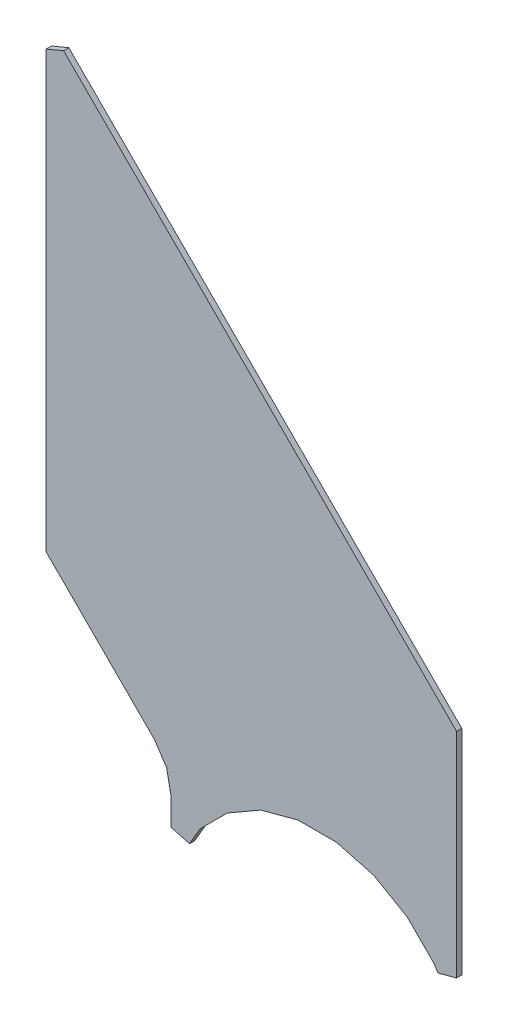
ISO-10303-21;
HEADER;
FILE_DESCRIPTION(('STEP AP214'),'2;1');
FILE_NAME('part.step','',(''),(''),'','','');
FILE_SCHEMA(('AUTOMOTIVE_DESIGN { 1 0 10303 214 1 1 1 1 }'));
ENDSEC;
DATA;
#1=APPLICATION_CONTEXT('core data for automotive mechanical design processes');
#2=APPLICATION_PROTOCOL_DEFINITION('international standard','automotive_design',2000,#1);
#3=PRODUCT_CONTEXT('',#1,'mechanical');
#4=PRODUCT('Part','Part','',(#3));
#5=PRODUCT_RELATED_PRODUCT_CATEGORY('part','',(#4));
#6=PRODUCT_DEFINITION_FORMATION('','',#4);
#7=PRODUCT_DEFINITION_CONTEXT('part definition',#1,'design');
#8=PRODUCT_DEFINITION('design','',#6,#7);
#9=PRODUCT_DEFINITION_SHAPE('','',#8);
#10=(LENGTH_UNIT() NAMED_UNIT(*) SI_UNIT(.MILLI.,.METRE.));
#11=(NAMED_UNIT(*) PLANE_ANGLE_UNIT() SI_UNIT($,.RADIAN.));
#12=(NAMED_UNIT(*) SI_UNIT($,.STERADIAN.) SOLID_ANGLE_UNIT());
#13=UNCERTAINTY_MEASURE_WITH_UNIT(LENGTH_MEASURE(1.E-05),#10,'distance_accuracy_value','');
#14=(GEOMETRIC_REPRESENTATION_CONTEXT(3) GLOBAL_UNCERTAINTY_ASSIGNED_CONTEXT((#13)) GLOBAL_UNIT_ASSIGNED_CONTEXT((#10,
#11,#12)) REPRESENTATION_CONTEXT('',''));
#15=CARTESIAN_POINT('',(0.,0.,0.));
#16=DIRECTION('',(0.,0.,1.));
#17=DIRECTION('',(1.,0.,0.));
#18=AXIS2_PLACEMENT_3D('',#15,#16,#17);
#19=CARTESIAN_POINT('',(87.1669998168945,97.3010025024414,0.));
#20=DIRECTION('',(0.383538164462081,-0.923525027490354,0.));
#21=DIRECTION('',(-0.923525027490354,-0.383538164462081,0.));
#22=AXIS2_PLACEMENT_3D('',#19,#20,#21);
#23=PLANE('',#22);
#24=DIRECTION('',(-0.923525027490354,-0.383538164462081,0.));
#25=VECTOR('',#24,1.);
#26=CARTESIAN_POINT('',(87.1669998168945,97.3010025024414,0.03556));
#27=LINE('',#26,#25);
#28=CARTESIAN_POINT('',(87.1669998168945,97.3010025024414,0.03556));
#29=VERTEX_POINT('',#28);
#30=CARTESIAN_POINT('',(87.0490036010742,97.2519989013672,0.03556));
#31=VERTEX_POINT('',#30);
#32=EDGE_CURVE('E11',#29,#31,#27,.T.);
#33=ORIENTED_EDGE('',*,*,#32,.F.);
#34=DIRECTION('',(0.,0.,1.));
#35=VECTOR('',#34,1.);
#36=CARTESIAN_POINT('',(87.1669998168945,97.3010025024414,0.));
#37=LINE('',#36,#35);
#38=CARTESIAN_POINT('',(87.1669998168945,97.3010025024414,0.));
#39=VERTEX_POINT('',#38);
#40=EDGE_CURVE('E24',#39,#29,#37,.T.);
#41=ORIENTED_EDGE('',*,*,#40,.F.);
#42=DIRECTION('',(-0.923525027490354,-0.383538164462081,0.));
#43=VECTOR('',#42,1.);
#44=CARTESIAN_POINT('',(87.1669998168945,97.3010025024414,0.));
#45=LINE('',#44,#43);
#46=CARTESIAN_POINT('',(87.0490036010742,97.2519989013672,0.));
#47=VERTEX_POINT('',#46);
#48=EDGE_CURVE('E166',#39,#47,#45,.T.);
#49=ORIENTED_EDGE('',*,*,#48,.T.);
#50=DIRECTION('',(0.,0.,1.));
#51=VECTOR('',#50,1.);
#52=CARTESIAN_POINT('',(87.0490036010742,97.2519989013672,0.));
#53=LINE('',#52,#51);
#54=EDGE_CURVE('E37',#47,#31,#53,.T.);
#55=ORIENTED_EDGE('',*,*,#54,.T.);
#56=EDGE_LOOP('',(#33,#41,#49,#55));
#57=FACE_BOUND('',#56,.T.);
#58=ADVANCED_FACE('F17',(#57),#23,.F.);
#59=CARTESIAN_POINT('',(87.0490036010742,97.2519989013672,0.));
#60=DIRECTION('',(1.,0.,0.));
#61=DIRECTION('',(0.,-1.,0.));
#62=AXIS2_PLACEMENT_3D('',#59,#60,#61);
#63=PLANE('',#62);
#64=DIRECTION('',(0.,-1.,0.));
#65=VECTOR('',#64,1.);
#66=CARTESIAN_POINT('',(87.0490036010742,97.2519989013672,0.03556));
#67=LINE('',#66,#65);
#68=CARTESIAN_POINT('',(87.0490036010742,94.2910003662109,0.03556));
#69=VERTEX_POINT('',#68);
#70=EDGE_CURVE('E294',#31,#69,#67,.T.);
#71=ORIENTED_EDGE('',*,*,#70,.F.);
#72=ORIENTED_EDGE('',*,*,#54,.F.);
#73=DIRECTION('',(0.,-1.,0.));
#74=VECTOR('',#73,1.);
#75=CARTESIAN_POINT('',(87.0490036010742,97.2519989013672,0.));
#76=LINE('',#75,#74);
#77=CARTESIAN_POINT('',(87.0490036010742,94.2910003662109,0.));
#78=VERTEX_POINT('',#77);
#79=EDGE_CURVE('E291',#47,#78,#76,.T.);
#80=ORIENTED_EDGE('',*,*,#79,.T.);
#81=DIRECTION('',(0.,0.,1.));
#82=VECTOR('',#81,1.);
#83=CARTESIAN_POINT('',(87.0490036010742,94.2910003662109,0.));
#84=LINE('',#83,#82);
#85=EDGE_CURVE('E289',#78,#69,#84,.T.);
#86=ORIENTED_EDGE('',*,*,#85,.T.);
#87=EDGE_LOOP('',(#71,#72,#80,#86));
#88=FACE_BOUND('',#87,.T.);
#89=ADVANCED_FACE('F302',(#88),#63,.F.);
#90=CARTESIAN_POINT('',(87.0490036010742,94.2910003662109,0.));
#91=DIRECTION('',(0.707106781186548,0.707106781186548,0.));
#92=DIRECTION('',(0.707106781186548,-0.707106781186548,0.));
#93=AXIS2_PLACEMENT_3D('',#90,#91,#92);
#94=PLANE('',#93);
#95=DIRECTION('',(0.707106781186548,-0.707106781186548,0.));
#96=VECTOR('',#95,1.);
#97=CARTESIAN_POINT('',(87.0490036010742,94.2910003662109,0.03556));
#98=LINE('',#97,#96);
#99=CARTESIAN_POINT('',(87.7850036621094,93.5550003051758,0.03556));
#100=VERTEX_POINT('',#99);
#101=EDGE_CURVE('E286',#69,#100,#98,.T.);
#102=ORIENTED_EDGE('',*,*,#101,.F.);
#103=ORIENTED_EDGE('',*,*,#85,.F.);
#104=DIRECTION('',(0.707106781186548,-0.707106781186548,0.));
#105=VECTOR('',#104,1.);
#106=CARTESIAN_POINT('',(87.0490036010742,94.2910003662109,0.));
#107=LINE('',#106,#105);
#108=CARTESIAN_POINT('',(87.7850036621094,93.5550003051758,0.));
#109=VERTEX_POINT('',#108);
#110=EDGE_CURVE('E283',#78,#109,#107,.T.);
#111=ORIENTED_EDGE('',*,*,#110,.T.);
#112=DIRECTION('',(0.,0.,1.));
#113=VECTOR('',#112,1.);
#114=CARTESIAN_POINT('',(87.7850036621094,93.5550003051758,0.));
#115=LINE('',#114,#113);
#116=EDGE_CURVE('E281',#109,#100,#115,.T.);
#117=ORIENTED_EDGE('',*,*,#116,.T.);
#118=EDGE_LOOP('',(#102,#103,#111,#117));
#119=FACE_BOUND('',#118,.T.);
#120=ADVANCED_FACE('F308',(#119),#94,.F.);
#121=CARTESIAN_POINT('',(87.7850036621094,93.5550003051758,0.));
#122=DIRECTION('',(0.832074114077194,0.554664464953951,0.));
#123=DIRECTION('',(0.554664464953951,-0.832074114077194,0.));
#124=AXIS2_PLACEMENT_3D('',#121,#122,#123);
#125=PLANE('',#124);
#126=DIRECTION('',(0.554664464953951,-0.832074114077194,0.));
#127=VECTOR('',#126,1.);
#128=CARTESIAN_POINT('',(87.7850036621094,93.5550003051758,0.03556));
#129=LINE('',#128,#127);
#130=CARTESIAN_POINT('',(87.8669967651367,93.431999206543,0.03556));
#131=VERTEX_POINT('',#130);
#132=EDGE_CURVE('E278',#100,#131,#129,.T.);
#133=ORIENTED_EDGE('',*,*,#132,.F.);
#134=ORIENTED_EDGE('',*,*,#116,.F.);
#135=DIRECTION('',(0.554664464953951,-0.832074114077194,0.));
#136=VECTOR('',#135,1.);
#137=CARTESIAN_POINT('',(87.7850036621094,93.5550003051758,0.));
#138=LINE('',#137,#136);
#139=CARTESIAN_POINT('',(87.8669967651367,93.431999206543,0.));
#140=VERTEX_POINT('',#139);
#141=EDGE_CURVE('E275',#109,#140,#138,.T.);
#142=ORIENTED_EDGE('',*,*,#141,.T.);
#143=DIRECTION('',(0.,0.,1.));
#144=VECTOR('',#143,1.);
#145=CARTESIAN_POINT('',(87.8669967651367,93.431999206543,0.));
#146=LINE('',#145,#144);
#147=EDGE_CURVE('E273',#140,#131,#146,.T.);
#148=ORIENTED_EDGE('',*,*,#147,.T.);
#149=EDGE_LOOP('',(#133,#134,#142,#148));
#150=FACE_BOUND('',#149,.T.);
#151=ADVANCED_FACE('F310',(#150),#125,.F.);
#152=CARTESIAN_POINT('',(87.8669967651367,93.431999206543,0.));
#153=DIRECTION('',(0.980570752241844,0.19616574585759,0.));
#154=DIRECTION('',(0.19616574585759,-0.980570752241844,0.));
#155=AXIS2_PLACEMENT_3D('',#152,#153,#154);
#156=PLANE('',#155);
#157=DIRECTION('',(0.19616574585759,-0.980570752241844,0.));
#158=VECTOR('',#157,1.);
#159=CARTESIAN_POINT('',(87.8669967651367,93.431999206543,0.03556));
#160=LINE('',#159,#158);
#161=CARTESIAN_POINT('',(87.8960037231445,93.2870025634766,0.03556));
#162=VERTEX_POINT('',#161);
#163=EDGE_CURVE('E270',#131,#162,#160,.T.);
#164=ORIENTED_EDGE('',*,*,#163,.F.);
#165=ORIENTED_EDGE('',*,*,#147,.F.);
#166=DIRECTION('',(0.19616574585759,-0.980570752241844,0.));
#167=VECTOR('',#166,1.);
#168=CARTESIAN_POINT('',(87.8669967651367,93.431999206543,0.));
#169=LINE('',#168,#167);
#170=CARTESIAN_POINT('',(87.8960037231445,93.2870025634766,0.));
#171=VERTEX_POINT('',#170);
#172=EDGE_CURVE('E267',#140,#171,#169,.T.);
#173=ORIENTED_EDGE('',*,*,#172,.T.);
#174=DIRECTION('',(0.,0.,1.));
#175=VECTOR('',#174,1.);
#176=CARTESIAN_POINT('',(87.8960037231445,93.2870025634766,0.));
#177=LINE('',#176,#175);
#178=EDGE_CURVE('E265',#171,#162,#177,.T.);
#179=ORIENTED_EDGE('',*,*,#178,.T.);
#180=EDGE_LOOP('',(#164,#165,#173,#179));
#181=FACE_BOUND('',#180,.T.);
#182=ADVANCED_FACE('F315',(#181),#156,.F.);
#183=CARTESIAN_POINT('',(87.8960037231445,93.2870025634766,0.));
#184=DIRECTION('',(1.,0.,0.));
#185=DIRECTION('',(0.,-1.,0.));
#186=AXIS2_PLACEMENT_3D('',#183,#184,#185);
#187=PLANE('',#186);
#188=DIRECTION('',(0.,-1.,0.));
#189=VECTOR('',#188,1.);
#190=CARTESIAN_POINT('',(87.8960037231445,93.2870025634766,0.03556));
#191=LINE('',#190,#189);
#192=CARTESIAN_POINT('',(87.8960037231445,93.0950012207031,0.03556));
#193=VERTEX_POINT('',#192);
#194=EDGE_CURVE('E262',#162,#193,#191,.T.);
#195=ORIENTED_EDGE('',*,*,#194,.F.);
#196=ORIENTED_EDGE('',*,*,#178,.F.);
#197=DIRECTION('',(0.,-1.,0.));
#198=VECTOR('',#197,1.);
#199=CARTESIAN_POINT('',(87.8960037231445,93.2870025634766,0.));
#200=LINE('',#199,#198);
#201=CARTESIAN_POINT('',(87.8960037231445,93.0950012207031,0.));
#202=VERTEX_POINT('',#201);
#203=EDGE_CURVE('E259',#171,#202,#200,.T.);
#204=ORIENTED_EDGE('',*,*,#203,.T.);
#205=DIRECTION('',(0.,0.,1.));
#206=VECTOR('',#205,1.);
#207=CARTESIAN_POINT('',(87.8960037231445,93.0950012207031,0.));
#208=LINE('',#207,#206);
#209=EDGE_CURVE('E257',#202,#193,#208,.T.);
#210=ORIENTED_EDGE('',*,*,#209,.T.);
#211=EDGE_LOOP('',(#195,#196,#204,#210));
#212=FACE_BOUND('',#211,.T.);
#213=ADVANCED_FACE('F318',(#212),#187,.F.);
#214=CARTESIAN_POINT('',(87.8960037231445,93.0950012207031,0.));
#215=DIRECTION('',(0.2586413292533,0.965973427585918,0.));
#216=DIRECTION('',(0.965973427585918,-0.2586413292533,0.));
#217=AXIS2_PLACEMENT_3D('',#214,#215,#216);
#218=PLANE('',#217);
#219=DIRECTION('',(0.965973427585918,-0.2586413292533,0.));
#220=VECTOR('',#219,1.);
#221=CARTESIAN_POINT('',(87.8960037231445,93.0950012207031,0.03556));
#222=LINE('',#221,#220);
#223=CARTESIAN_POINT('',(88.0230026245117,93.0609970092774,0.03556));
#224=VERTEX_POINT('',#223);
#225=EDGE_CURVE('E254',#193,#224,#222,.T.);
#226=ORIENTED_EDGE('',*,*,#225,.F.);
#227=ORIENTED_EDGE('',*,*,#209,.F.);
#228=DIRECTION('',(0.965973427585918,-0.2586413292533,0.));
#229=VECTOR('',#228,1.);
#230=CARTESIAN_POINT('',(87.8960037231445,93.0950012207031,0.));
#231=LINE('',#230,#229);
#232=CARTESIAN_POINT('',(88.0230026245117,93.0609970092774,0.));
#233=VERTEX_POINT('',#232);
#234=EDGE_CURVE('E251',#202,#233,#231,.T.);
#235=ORIENTED_EDGE('',*,*,#234,.T.);
#236=DIRECTION('',(0.,0.,1.));
#237=VECTOR('',#236,1.);
#238=CARTESIAN_POINT('',(88.0230026245117,93.0609970092774,0.));
#239=LINE('',#238,#237);
#240=EDGE_CURVE('E249',#233,#224,#239,.T.);
#241=ORIENTED_EDGE('',*,*,#240,.T.);
#242=EDGE_LOOP('',(#226,#227,#235,#241));
#243=FACE_BOUND('',#242,.T.);
#244=ADVANCED_FACE('F323',(#243),#218,.F.);
#245=CARTESIAN_POINT('',(88.0230026245117,93.0609970092774,0.));
#246=DIRECTION('',(-0.864794163873289,0.502126531992385,0.));
#247=DIRECTION('',(0.502126531992385,0.864794163873289,0.));
#248=AXIS2_PLACEMENT_3D('',#245,#246,#247);
#249=PLANE('',#248);
#250=DIRECTION('',(0.502126531992385,0.864794163873289,0.));
#251=VECTOR('',#250,1.);
#252=CARTESIAN_POINT('',(88.0230026245117,93.0609970092774,0.03556));
#253=LINE('',#252,#251);
#254=CARTESIAN_POINT('',(88.0950012207031,93.1849975585938,0.03556));
#255=VERTEX_POINT('',#254);
#256=EDGE_CURVE('E246',#224,#255,#253,.T.);
#257=ORIENTED_EDGE('',*,*,#256,.F.);
#258=ORIENTED_EDGE('',*,*,#240,.F.);
#259=DIRECTION('',(0.502126531992385,0.864794163873289,0.));
#260=VECTOR('',#259,1.);
#261=CARTESIAN_POINT('',(88.0230026245117,93.0609970092774,0.));
#262=LINE('',#261,#260);
#263=CARTESIAN_POINT('',(88.0950012207031,93.1849975585938,0.));
#264=VERTEX_POINT('',#263);
#265=EDGE_CURVE('E243',#233,#264,#262,.T.);
#266=ORIENTED_EDGE('',*,*,#265,.T.);
#267=DIRECTION('',(0.,0.,1.));
#268=VECTOR('',#267,1.);
#269=CARTESIAN_POINT('',(88.0950012207031,93.1849975585938,0.));
#270=LINE('',#269,#268);
#271=EDGE_CURVE('E241',#264,#255,#270,.T.);
#272=ORIENTED_EDGE('',*,*,#271,.T.);
#273=EDGE_LOOP('',(#257,#258,#266,#272));
#274=FACE_BOUND('',#273,.T.);
#275=ADVANCED_FACE('F326',(#274),#249,.F.);
#276=CARTESIAN_POINT('',(88.0950012207031,93.1849975585938,0.));
#277=DIRECTION('',(-0.707121361459365,0.707092200613084,0.));
#278=DIRECTION('',(0.707092200613084,0.707121361459365,0.));
#279=AXIS2_PLACEMENT_3D('',#276,#277,#278);
#280=PLANE('',#279);
#281=DIRECTION('',(0.707092200613084,0.707121361459365,0.));
#282=VECTOR('',#281,1.);
#283=CARTESIAN_POINT('',(88.0950012207031,93.1849975585938,0.03556));
#284=LINE('',#283,#282);
#285=CARTESIAN_POINT('',(88.2799987792969,93.370002746582,0.03556));
#286=VERTEX_POINT('',#285);
#287=EDGE_CURVE('E238',#255,#286,#284,.T.);
#288=ORIENTED_EDGE('',*,*,#287,.F.);
#289=ORIENTED_EDGE('',*,*,#271,.F.);
#290=DIRECTION('',(0.707092200613084,0.707121361459365,0.));
#291=VECTOR('',#290,1.);
#292=CARTESIAN_POINT('',(88.0950012207031,93.1849975585938,0.));
#293=LINE('',#292,#291);
#294=CARTESIAN_POINT('',(88.2799987792969,93.370002746582,0.));
#295=VERTEX_POINT('',#294);
#296=EDGE_CURVE('E235',#264,#295,#293,.T.);
#297=ORIENTED_EDGE('',*,*,#296,.T.);
#298=DIRECTION('',(0.,0.,1.));
#299=VECTOR('',#298,1.);
#300=CARTESIAN_POINT('',(88.2799987792969,93.370002746582,0.));
#301=LINE('',#300,#299);
#302=EDGE_CURVE('E233',#295,#286,#301,.T.);
#303=ORIENTED_EDGE('',*,*,#302,.T.);
#304=EDGE_LOOP('',(#288,#289,#297,#303));
#305=FACE_BOUND('',#304,.T.);
#306=ADVANCED_FACE('F331',(#305),#280,.F.);
#307=CARTESIAN_POINT('',(88.2799987792969,93.370002746582,0.));
#308=DIRECTION('',(-0.499814852376596,0.866132272429426,0.));
#309=DIRECTION('',(0.866132272429426,0.499814852376596,0.));
#310=AXIS2_PLACEMENT_3D('',#307,#308,#309);
#311=PLANE('',#310);
#312=DIRECTION('',(0.866132272429426,0.499814852376596,0.));
#313=VECTOR('',#312,1.);
#314=CARTESIAN_POINT('',(88.2799987792969,93.370002746582,0.03556));
#315=LINE('',#314,#313);
#316=CARTESIAN_POINT('',(88.5070037841797,93.5009994506836,0.03556));
#317=VERTEX_POINT('',#316);
#318=EDGE_CURVE('E230',#286,#317,#315,.T.);
#319=ORIENTED_EDGE('',*,*,#318,.F.);
#320=ORIENTED_EDGE('',*,*,#302,.F.);
#321=DIRECTION('',(0.866132272429426,0.499814852376596,0.));
#322=VECTOR('',#321,1.);
#323=CARTESIAN_POINT('',(88.2799987792969,93.370002746582,0.));
#324=LINE('',#323,#322);
#325=CARTESIAN_POINT('',(88.5070037841797,93.5009994506836,0.));
#326=VERTEX_POINT('',#325);
#327=EDGE_CURVE('E227',#295,#326,#324,.T.);
#328=ORIENTED_EDGE('',*,*,#327,.T.);
#329=DIRECTION('',(0.,0.,1.));
#330=VECTOR('',#329,1.);
#331=CARTESIAN_POINT('',(88.5070037841797,93.5009994506836,0.));
#332=LINE('',#331,#330);
#333=EDGE_CURVE('E225',#326,#317,#332,.T.);
#334=ORIENTED_EDGE('',*,*,#333,.T.);
#335=EDGE_LOOP('',(#319,#320,#328,#334));
#336=FACE_BOUND('',#335,.T.);
#337=ADVANCED_FACE('F334',(#336),#311,.F.);
#338=CARTESIAN_POINT('',(88.5070037841797,93.5009994506836,0.));
#339=DIRECTION('',(-0.259567184116524,0.965725052450136,0.));
#340=DIRECTION('',(0.965725052450136,0.259567184116524,0.));
#341=AXIS2_PLACEMENT_3D('',#338,#339,#340);
#342=PLANE('',#341);
#343=DIRECTION('',(0.965725052450136,0.259567184116524,0.));
#344=VECTOR('',#343,1.);
#345=CARTESIAN_POINT('',(88.5070037841797,93.5009994506836,0.03556));
#346=LINE('',#345,#344);
#347=CARTESIAN_POINT('',(88.7600021362305,93.5690002441406,0.03556));
#348=VERTEX_POINT('',#347);
#349=EDGE_CURVE('E222',#317,#348,#346,.T.);
#350=ORIENTED_EDGE('',*,*,#349,.F.);
#351=ORIENTED_EDGE('',*,*,#333,.F.);
#352=DIRECTION('',(0.965725052450136,0.259567184116524,0.));
#353=VECTOR('',#352,1.);
#354=CARTESIAN_POINT('',(88.5070037841797,93.5009994506836,0.));
#355=LINE('',#354,#353);
#356=CARTESIAN_POINT('',(88.7600021362305,93.5690002441406,0.));
#357=VERTEX_POINT('',#356);
#358=EDGE_CURVE('E219',#326,#357,#355,.T.);
#359=ORIENTED_EDGE('',*,*,#358,.T.);
#360=DIRECTION('',(0.,0.,1.));
#361=VECTOR('',#360,1.);
#362=CARTESIAN_POINT('',(88.7600021362305,93.5690002441406,0.));
#363=LINE('',#362,#361);
#364=EDGE_CURVE('E217',#357,#348,#363,.T.);
#365=ORIENTED_EDGE('',*,*,#364,.T.);
#366=EDGE_LOOP('',(#350,#351,#359,#365));
#367=FACE_BOUND('',#366,.T.);
#368=ADVANCED_FACE('F339',(#367),#342,.F.);
#369=CARTESIAN_POINT('',(88.7600021362305,93.5690002441406,0.));
#370=DIRECTION('',(0.,1.,0.));
#371=DIRECTION('',(1.,0.,0.));
#372=AXIS2_PLACEMENT_3D('',#369,#370,#371);
#373=PLANE('',#372);
#374=DIRECTION('',(1.,0.,0.));
#375=VECTOR('',#374,1.);
#376=CARTESIAN_POINT('',(88.7600021362305,93.5690002441406,0.03556));
#377=LINE('',#376,#375);
#378=CARTESIAN_POINT('',(89.0220031738281,93.5690002441406,0.03556));
#379=VERTEX_POINT('',#378);
#380=EDGE_CURVE('E214',#348,#379,#377,.T.);
#381=ORIENTED_EDGE('',*,*,#380,.F.);
#382=ORIENTED_EDGE('',*,*,#364,.F.);
#383=DIRECTION('',(1.,0.,0.));
#384=VECTOR('',#383,1.);
#385=CARTESIAN_POINT('',(88.7600021362305,93.5690002441406,0.));
#386=LINE('',#385,#384);
#387=CARTESIAN_POINT('',(89.0220031738281,93.5690002441406,0.));
#388=VERTEX_POINT('',#387);
#389=EDGE_CURVE('E211',#357,#388,#386,.T.);
#390=ORIENTED_EDGE('',*,*,#389,.T.);
#391=DIRECTION('',(0.,0.,1.));
#392=VECTOR('',#391,1.);
#393=CARTESIAN_POINT('',(89.0220031738281,93.5690002441406,0.));
#394=LINE('',#393,#392);
#395=EDGE_CURVE('E209',#388,#379,#394,.T.);
#396=ORIENTED_EDGE('',*,*,#395,.T.);
#397=EDGE_LOOP('',(#381,#382,#390,#396));
#398=FACE_BOUND('',#397,.T.);
#399=ADVANCED_FACE('F342',(#398),#373,.F.);
#400=CARTESIAN_POINT('',(89.0220031738281,93.5690002441406,0.));
#401=DIRECTION('',(0.259567184116524,0.965725052450136,0.));
#402=DIRECTION('',(0.965725052450136,-0.259567184116524,0.));
#403=AXIS2_PLACEMENT_3D('',#400,#401,#402);
#404=PLANE('',#403);
#405=DIRECTION('',(0.965725052450136,-0.259567184116524,0.));
#406=VECTOR('',#405,1.);
#407=CARTESIAN_POINT('',(89.0220031738281,93.5690002441406,0.03556));
#408=LINE('',#407,#406);
#409=CARTESIAN_POINT('',(89.2750015258789,93.5009994506836,0.03556));
#410=VERTEX_POINT('',#409);
#411=EDGE_CURVE('E206',#379,#410,#408,.T.);
#412=ORIENTED_EDGE('',*,*,#411,.F.);
#413=ORIENTED_EDGE('',*,*,#395,.F.);
#414=DIRECTION('',(0.965725052450136,-0.259567184116524,0.));
#415=VECTOR('',#414,1.);
#416=CARTESIAN_POINT('',(89.0220031738281,93.5690002441406,0.));
#417=LINE('',#416,#415);
#418=CARTESIAN_POINT('',(89.2750015258789,93.5009994506836,0.));
#419=VERTEX_POINT('',#418);
#420=EDGE_CURVE('E203',#388,#419,#417,.T.);
#421=ORIENTED_EDGE('',*,*,#420,.T.);
#422=DIRECTION('',(0.,0.,1.));
#423=VECTOR('',#422,1.);
#424=CARTESIAN_POINT('',(89.2750015258789,93.5009994506836,0.));
#425=LINE('',#424,#423);
#426=EDGE_CURVE('E201',#419,#410,#425,.T.);
#427=ORIENTED_EDGE('',*,*,#426,.T.);
#428=EDGE_LOOP('',(#412,#413,#421,#427));
#429=FACE_BOUND('',#428,.T.);
#430=ADVANCED_FACE('F347',(#429),#404,.F.);
#431=CARTESIAN_POINT('',(89.2750015258789,93.5009994506836,0.));
#432=DIRECTION('',(0.499827454431494,0.866125000099023,0.));
#433=DIRECTION('',(0.866125000099023,-0.499827454431494,0.));
#434=AXIS2_PLACEMENT_3D('',#431,#432,#433);
#435=PLANE('',#434);
#436=DIRECTION('',(0.866125000099023,-0.499827454431494,0.));
#437=VECTOR('',#436,1.);
#438=CARTESIAN_POINT('',(89.2750015258789,93.5009994506836,0.03556));
#439=LINE('',#438,#437);
#440=CARTESIAN_POINT('',(89.5019989013672,93.370002746582,0.03556));
#441=VERTEX_POINT('',#440);
#442=EDGE_CURVE('E198',#410,#441,#439,.T.);
#443=ORIENTED_EDGE('',*,*,#442,.F.);
#444=ORIENTED_EDGE('',*,*,#426,.F.);
#445=DIRECTION('',(0.866125000099023,-0.499827454431494,0.));
#446=VECTOR('',#445,1.);
#447=CARTESIAN_POINT('',(89.2750015258789,93.5009994506836,0.));
#448=LINE('',#447,#446);
#449=CARTESIAN_POINT('',(89.5019989013672,93.370002746582,0.));
#450=VERTEX_POINT('',#449);
#451=EDGE_CURVE('E195',#419,#450,#448,.T.);
#452=ORIENTED_EDGE('',*,*,#451,.T.);
#453=DIRECTION('',(0.,0.,1.));
#454=VECTOR('',#453,1.);
#455=CARTESIAN_POINT('',(89.5019989013672,93.370002746582,0.));
#456=LINE('',#455,#454);
#457=EDGE_CURVE('E193',#450,#441,#456,.T.);
#458=ORIENTED_EDGE('',*,*,#457,.T.);
#459=EDGE_LOOP('',(#443,#444,#452,#458));
#460=FACE_BOUND('',#459,.T.);
#461=ADVANCED_FACE('F350',(#460),#435,.F.);
#462=CARTESIAN_POINT('',(89.5019989013672,93.370002746582,0.));
#463=DIRECTION('',(0.707121361459365,0.707092200613084,0.));
#464=DIRECTION('',(0.707092200613084,-0.707121361459365,0.));
#465=AXIS2_PLACEMENT_3D('',#462,#463,#464);
#466=PLANE('',#465);
#467=DIRECTION('',(0.707092200613084,-0.707121361459365,0.));
#468=VECTOR('',#467,1.);
#469=CARTESIAN_POINT('',(89.5019989013672,93.370002746582,0.03556));
#470=LINE('',#469,#468);
#471=CARTESIAN_POINT('',(89.6869964599609,93.1849975585938,0.03556));
#472=VERTEX_POINT('',#471);
#473=EDGE_CURVE('E190',#441,#472,#470,.T.);
#474=ORIENTED_EDGE('',*,*,#473,.F.);
#475=ORIENTED_EDGE('',*,*,#457,.F.);
#476=DIRECTION('',(0.707092200613084,-0.707121361459365,0.));
#477=VECTOR('',#476,1.);
#478=CARTESIAN_POINT('',(89.5019989013672,93.370002746582,0.));
#479=LINE('',#478,#477);
#480=CARTESIAN_POINT('',(89.6869964599609,93.1849975585938,0.));
#481=VERTEX_POINT('',#480);
#482=EDGE_CURVE('E187',#450,#481,#479,.T.);
#483=ORIENTED_EDGE('',*,*,#482,.T.);
#484=DIRECTION('',(0.,0.,1.));
#485=VECTOR('',#484,1.);
#486=CARTESIAN_POINT('',(89.6869964599609,93.1849975585938,0.));
#487=LINE('',#486,#485);
#488=EDGE_CURVE('E185',#481,#472,#487,.T.);
#489=ORIENTED_EDGE('',*,*,#488,.T.);
#490=EDGE_LOOP('',(#474,#475,#483,#489));
#491=FACE_BOUND('',#490,.T.);
#492=ADVANCED_FACE('F355',(#491),#466,.F.);
#493=CARTESIAN_POINT('',(89.6869964599609,93.1849975585938,0.));
#494=DIRECTION('',(0.862997392643225,0.505208373140228,0.));
#495=DIRECTION('',(0.505208373140228,-0.862997392643225,0.));
#496=AXIS2_PLACEMENT_3D('',#493,#494,#495);
#497=PLANE('',#496);
#498=DIRECTION('',(0.505208373140228,-0.862997392643225,0.));
#499=VECTOR('',#498,1.);
#500=CARTESIAN_POINT('',(89.6869964599609,93.1849975585938,0.03556));
#501=LINE('',#500,#499);
#502=CARTESIAN_POINT('',(89.7109985351562,93.1439971923828,0.03556));
#503=VERTEX_POINT('',#502);
#504=EDGE_CURVE('E182',#472,#503,#501,.T.);
#505=ORIENTED_EDGE('',*,*,#504,.F.);
#506=ORIENTED_EDGE('',*,*,#488,.F.);
#507=DIRECTION('',(0.505208373140228,-0.862997392643225,0.));
#508=VECTOR('',#507,1.);
#509=CARTESIAN_POINT('',(89.6869964599609,93.1849975585938,0.));
#510=LINE('',#509,#508);
#511=CARTESIAN_POINT('',(89.7109985351562,93.1439971923828,0.));
#512=VERTEX_POINT('',#511);
#513=EDGE_CURVE('E179',#481,#512,#510,.T.);
#514=ORIENTED_EDGE('',*,*,#513,.T.);
#515=DIRECTION('',(0.,0.,1.));
#516=VECTOR('',#515,1.);
#517=CARTESIAN_POINT('',(89.7109985351562,93.1439971923828,0.));
#518=LINE('',#517,#516);
#519=EDGE_CURVE('E177',#512,#503,#518,.T.);
#520=ORIENTED_EDGE('',*,*,#519,.T.);
#521=EDGE_LOOP('',(#505,#506,#514,#520));
#522=FACE_BOUND('',#521,.T.);
#523=ADVANCED_FACE('F358',(#522),#497,.F.);
#524=CARTESIAN_POINT('',(89.7109985351562,93.1439971923828,0.));
#525=DIRECTION('',(-0.2586413292533,0.965973427585918,0.));
#526=DIRECTION('',(0.965973427585918,0.2586413292533,0.));
#527=AXIS2_PLACEMENT_3D('',#524,#525,#526);
#528=PLANE('',#527);
#529=DIRECTION('',(0.965973427585918,0.2586413292533,0.));
#530=VECTOR('',#529,1.);
#531=CARTESIAN_POINT('',(89.7109985351562,93.1439971923828,0.03556));
#532=LINE('',#531,#530);
#533=CARTESIAN_POINT('',(89.8379974365234,93.1780014038086,0.03556));
#534=VERTEX_POINT('',#533);
#535=EDGE_CURVE('E174',#503,#534,#532,.T.);
#536=ORIENTED_EDGE('',*,*,#535,.F.);
#537=ORIENTED_EDGE('',*,*,#519,.F.);
#538=DIRECTION('',(0.965973427585918,0.2586413292533,0.));
#539=VECTOR('',#538,1.);
#540=CARTESIAN_POINT('',(89.7109985351562,93.1439971923828,0.));
#541=LINE('',#540,#539);
#542=CARTESIAN_POINT('',(89.8379974365234,93.1780014038086,0.));
#543=VERTEX_POINT('',#542);
#544=EDGE_CURVE('E172',#512,#543,#541,.T.);
#545=ORIENTED_EDGE('',*,*,#544,.T.);
#546=DIRECTION('',(0.,0.,1.));
#547=VECTOR('',#546,1.);
#548=CARTESIAN_POINT('',(89.8379974365234,93.1780014038086,0.));
#549=LINE('',#548,#547);
#550=EDGE_CURVE('E157',#543,#534,#549,.T.);
#551=ORIENTED_EDGE('',*,*,#550,.T.);
#552=EDGE_LOOP('',(#536,#537,#545,#551));
#553=FACE_BOUND('',#552,.T.);
#554=ADVANCED_FACE('F361',(#553),#528,.F.);
#555=CARTESIAN_POINT('',(89.8379974365235,93.1780014038086,0.));
#556=DIRECTION('',(-1.,0.,0.));
#557=DIRECTION('',(0.,1.,0.));
#558=AXIS2_PLACEMENT_3D('',#555,#556,#557);
#559=PLANE('',#558);
#560=DIRECTION('',(0.,1.,0.));
#561=VECTOR('',#560,1.);
#562=CARTESIAN_POINT('',(89.8379974365234,93.1780014038086,0.03556));
#563=LINE('',#562,#561);
#564=CARTESIAN_POINT('',(89.8379974365234,94.629997253418,0.03556));
#565=VERTEX_POINT('',#564);
#566=EDGE_CURVE('E161',#534,#565,#563,.T.);
#567=ORIENTED_EDGE('',*,*,#566,.F.);
#568=ORIENTED_EDGE('',*,*,#550,.F.);
#569=DIRECTION('',(0.,1.,0.));
#570=VECTOR('',#569,1.);
#571=CARTESIAN_POINT('',(89.8379974365234,93.1780014038086,0.));
#572=LINE('',#571,#570);
#573=CARTESIAN_POINT('',(89.8379974365234,94.629997253418,0.));
#574=VERTEX_POINT('',#573);
#575=EDGE_CURVE('E153',#543,#574,#572,.T.);
#576=ORIENTED_EDGE('',*,*,#575,.T.);
#577=DIRECTION('',(0.,0.,1.));
#578=VECTOR('',#577,1.);
#579=CARTESIAN_POINT('',(89.8379974365234,94.629997253418,0.));
#580=LINE('',#579,#578);
#581=EDGE_CURVE('E143',#574,#565,#580,.T.);
#582=ORIENTED_EDGE('',*,*,#581,.T.);
#583=EDGE_LOOP('',(#567,#568,#576,#582));
#584=FACE_BOUND('',#583,.T.);
#585=ADVANCED_FACE('F156',(#584),#559,.F.);
#586=CARTESIAN_POINT('',(89.8379974365235,94.629997253418,0.));
#587=DIRECTION('',(-0.707107791068588,-0.707105771303065,0.));
#588=DIRECTION('',(-0.707105771303065,0.707107791068588,0.));
#589=AXIS2_PLACEMENT_3D('',#586,#587,#588);
#590=PLANE('',#589);
#591=DIRECTION('',(-0.707105771303065,0.707107791068588,0.));
#592=VECTOR('',#591,1.);
#593=CARTESIAN_POINT('',(89.8379974365234,94.629997253418,0.03556));
#594=LINE('',#593,#592);
#595=EDGE_CURVE('E149',#565,#29,#594,.T.);
#596=ORIENTED_EDGE('',*,*,#595,.F.);
#597=ORIENTED_EDGE('',*,*,#581,.F.);
#598=DIRECTION('',(-0.707105771303065,0.707107791068588,0.));
#599=VECTOR('',#598,1.);
#600=CARTESIAN_POINT('',(89.8379974365234,94.629997253418,0.));
#601=LINE('',#600,#599);
#602=EDGE_CURVE('E147',#574,#39,#601,.T.);
#603=ORIENTED_EDGE('',*,*,#602,.T.);
#604=ORIENTED_EDGE('',*,*,#40,.T.);
#605=EDGE_LOOP('',(#596,#597,#603,#604));
#606=FACE_BOUND('',#605,.T.);
#607=ADVANCED_FACE('F145',(#606),#590,.F.);
#608=CARTESIAN_POINT('',(87.1669998168945,97.3010025024414,0.));
#609=DIRECTION('',(0.,0.,-1.));
#610=DIRECTION('',(-1.,0.,0.));
#611=AXIS2_PLACEMENT_3D('',#608,#609,#610);
#612=PLANE('',#611);
#613=ORIENTED_EDGE('',*,*,#602,.F.);
#614=ORIENTED_EDGE('',*,*,#575,.F.);
#615=ORIENTED_EDGE('',*,*,#544,.F.);
#616=ORIENTED_EDGE('',*,*,#513,.F.);
#617=ORIENTED_EDGE('',*,*,#482,.F.);
#618=ORIENTED_EDGE('',*,*,#451,.F.);
#619=ORIENTED_EDGE('',*,*,#420,.F.);
#620=ORIENTED_EDGE('',*,*,#389,.F.);
#621=ORIENTED_EDGE('',*,*,#358,.F.);
#622=ORIENTED_EDGE('',*,*,#327,.F.);
#623=ORIENTED_EDGE('',*,*,#296,.F.);
#624=ORIENTED_EDGE('',*,*,#265,.F.);
#625=ORIENTED_EDGE('',*,*,#234,.F.);
#626=ORIENTED_EDGE('',*,*,#203,.F.);
#627=ORIENTED_EDGE('',*,*,#172,.F.);
#628=ORIENTED_EDGE('',*,*,#141,.F.);
#629=ORIENTED_EDGE('',*,*,#110,.F.);
#630=ORIENTED_EDGE('',*,*,#79,.F.);
#631=ORIENTED_EDGE('',*,*,#48,.F.);
#632=EDGE_LOOP('',(#613,#614,#615,#616,#617,#618,#619,#620,#621,#622,#623,#624,#625,#626,#627,
#628,#629,#630,#631));
#633=FACE_BOUND('',#632,.T.);
#634=ADVANCED_FACE('F164',(#633),#612,.T.);
#635=CARTESIAN_POINT('',(87.1669998168945,97.3010025024414,0.03556));
#636=DIRECTION('',(0.,0.,-1.));
#637=DIRECTION('',(-1.,0.,0.));
#638=AXIS2_PLACEMENT_3D('',#635,#636,#637);
#639=PLANE('',#638);
#640=ORIENTED_EDGE('',*,*,#32,.T.);
#641=ORIENTED_EDGE('',*,*,#70,.T.);
#642=ORIENTED_EDGE('',*,*,#101,.T.);
#643=ORIENTED_EDGE('',*,*,#132,.T.);
#644=ORIENTED_EDGE('',*,*,#163,.T.);
#645=ORIENTED_EDGE('',*,*,#194,.T.);
#646=ORIENTED_EDGE('',*,*,#225,.T.);
#647=ORIENTED_EDGE('',*,*,#256,.T.);
#648=ORIENTED_EDGE('',*,*,#287,.T.);
#649=ORIENTED_EDGE('',*,*,#318,.T.);
#650=ORIENTED_EDGE('',*,*,#349,.T.);
#651=ORIENTED_EDGE('',*,*,#380,.T.);
#652=ORIENTED_EDGE('',*,*,#411,.T.);
#653=ORIENTED_EDGE('',*,*,#442,.T.);
#654=ORIENTED_EDGE('',*,*,#473,.T.);
#655=ORIENTED_EDGE('',*,*,#504,.T.);
#656=ORIENTED_EDGE('',*,*,#535,.T.);
#657=ORIENTED_EDGE('',*,*,#566,.T.);
#658=ORIENTED_EDGE('',*,*,#595,.T.);
#659=EDGE_LOOP('',(#640,#641,#642,#643,#644,#645,#646,#647,#648,#649,#650,#651,#652,#653,#654,
#655,#656,#657,#658));
#660=FACE_BOUND('',#659,.T.);
#661=ADVANCED_FACE('F305',(#660),#639,.F.);
#662=CLOSED_SHELL('',(#58,#89,#120,#151,#182,#213,#244,#275,#306,#337,#368,#399,#430,#461,#492,
#523,#554,#585,#607,#634,#661));
#663=MANIFOLD_SOLID_BREP('B1',#662);
#664=ADVANCED_BREP_SHAPE_REPRESENTATION('',(#18,#663),#14);
#665=SHAPE_DEFINITION_REPRESENTATION(#9,#664);
ENDSEC;
END-ISO-10303-21;
